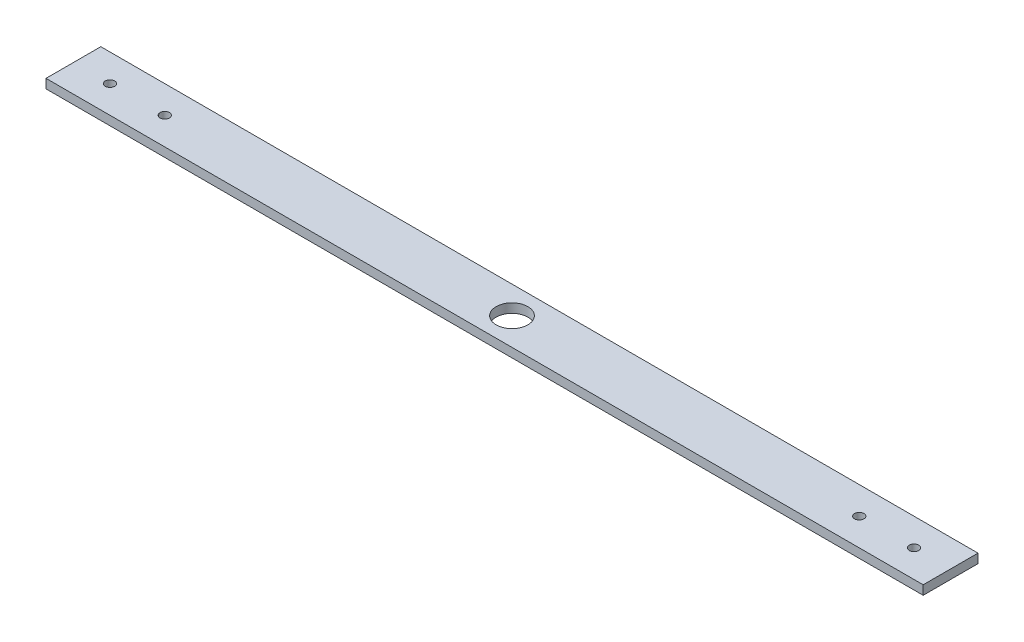
ISO-10303-21;
HEADER;
FILE_DESCRIPTION(('STEP AP214'),'2;1');
FILE_NAME('part.step','',(''),(''),'','','');
FILE_SCHEMA(('AUTOMOTIVE_DESIGN { 1 0 10303 214 1 1 1 1 }'));
ENDSEC;
DATA;
#1=APPLICATION_CONTEXT('core data for automotive mechanical design processes');
#2=APPLICATION_PROTOCOL_DEFINITION('international standard','automotive_design',2000,#1);
#3=PRODUCT_CONTEXT('',#1,'mechanical');
#4=PRODUCT('Part','Part','',(#3));
#5=PRODUCT_RELATED_PRODUCT_CATEGORY('part','',(#4));
#6=PRODUCT_DEFINITION_FORMATION('','',#4);
#7=PRODUCT_DEFINITION_CONTEXT('part definition',#1,'design');
#8=PRODUCT_DEFINITION('design','',#6,#7);
#9=PRODUCT_DEFINITION_SHAPE('','',#8);
#10=(LENGTH_UNIT() NAMED_UNIT(*) SI_UNIT(.MILLI.,.METRE.));
#11=(NAMED_UNIT(*) PLANE_ANGLE_UNIT() SI_UNIT($,.RADIAN.));
#12=(NAMED_UNIT(*) SI_UNIT($,.STERADIAN.) SOLID_ANGLE_UNIT());
#13=UNCERTAINTY_MEASURE_WITH_UNIT(LENGTH_MEASURE(1.E-05),#10,'distance_accuracy_value','');
#14=(GEOMETRIC_REPRESENTATION_CONTEXT(3) GLOBAL_UNCERTAINTY_ASSIGNED_CONTEXT((#13)) GLOBAL_UNIT_ASSIGNED_CONTEXT((#10,
#11,#12)) REPRESENTATION_CONTEXT('',''));
#15=CARTESIAN_POINT('',(0.,0.,0.));
#16=DIRECTION('',(0.,0.,1.));
#17=DIRECTION('',(1.,0.,0.));
#18=AXIS2_PLACEMENT_3D('',#15,#16,#17);
#19=CARTESIAN_POINT('',(0.,0.,0.));
#20=DIRECTION('',(0.,-1.,0.));
#21=DIRECTION('',(0.,0.,-1.));
#22=AXIS2_PLACEMENT_3D('',#19,#20,#21);
#23=PLANE('',#22);
#24=DIRECTION('',(0.,0.,-1.));
#25=VECTOR('',#24,1.);
#26=CARTESIAN_POINT('',(304.8,0.,19.05));
#27=LINE('',#26,#25);
#28=CARTESIAN_POINT('',(304.8,0.,19.05));
#29=VERTEX_POINT('',#28);
#30=CARTESIAN_POINT('',(304.8,0.,-19.05));
#31=VERTEX_POINT('',#30);
#32=EDGE_CURVE('E112',#29,#31,#27,.T.);
#33=ORIENTED_EDGE('',*,*,#32,.F.);
#34=DIRECTION('',(1.,0.,0.));
#35=VECTOR('',#34,1.);
#36=CARTESIAN_POINT('',(-304.8,0.,19.05));
#37=LINE('',#36,#35);
#38=CARTESIAN_POINT('',(-304.8,0.,19.05));
#39=VERTEX_POINT('',#38);
#40=EDGE_CURVE('E82',#39,#29,#37,.T.);
#41=ORIENTED_EDGE('',*,*,#40,.F.);
#42=DIRECTION('',(0.,0.,1.));
#43=VECTOR('',#42,1.);
#44=CARTESIAN_POINT('',(-304.8,0.,19.05));
#45=LINE('',#44,#43);
#46=CARTESIAN_POINT('',(-304.8,0.,-19.05));
#47=VERTEX_POINT('',#46);
#48=EDGE_CURVE('E76',#47,#39,#45,.T.);
#49=ORIENTED_EDGE('',*,*,#48,.F.);
#50=DIRECTION('',(-1.,0.,0.));
#51=VECTOR('',#50,1.);
#52=CARTESIAN_POINT('',(-304.8,0.,-19.05));
#53=LINE('',#52,#51);
#54=EDGE_CURVE('E99',#31,#47,#53,.T.);
#55=ORIENTED_EDGE('',*,*,#54,.F.);
#56=EDGE_LOOP('',(#33,#41,#49,#55));
#57=FACE_BOUND('',#56,.T.);
#58=CARTESIAN_POINT('',(0.,0.,0.));
#59=DIRECTION('',(0.,-1.,0.));
#60=DIRECTION('',(0.,0.,-1.));
#61=AXIS2_PLACEMENT_3D('',#58,#59,#60);
#62=CIRCLE('',#61,11.);
#63=CARTESIAN_POINT('',(0.,0.,-11.));
#64=VERTEX_POINT('',#63);
#65=EDGE_CURVE('E44',#64,#64,#62,.T.);
#66=ORIENTED_EDGE('',*,*,#65,.F.);
#67=EDGE_LOOP('',(#66));
#68=FACE_BOUND('',#67,.T.);
#69=CARTESIAN_POINT('',(-241.3,0.,0.));
#70=DIRECTION('',(0.,1.,0.));
#71=DIRECTION('',(0.,0.,1.));
#72=AXIS2_PLACEMENT_3D('',#69,#70,#71);
#73=CIRCLE('',#72,3.26389999999999);
#74=CARTESIAN_POINT('',(-241.3,0.,3.26390000000002));
#75=VERTEX_POINT('',#74);
#76=EDGE_CURVE('E138',#75,#75,#73,.T.);
#77=ORIENTED_EDGE('',*,*,#76,.T.);
#78=EDGE_LOOP('',(#77));
#79=FACE_BOUND('',#78,.T.);
#80=CARTESIAN_POINT('',(-279.4,0.,0.));
#81=DIRECTION('',(0.,1.,0.));
#82=DIRECTION('',(0.,0.,1.));
#83=AXIS2_PLACEMENT_3D('',#80,#81,#82);
#84=CIRCLE('',#83,3.26389999999999);
#85=CARTESIAN_POINT('',(-279.4,0.,3.26390000000002));
#86=VERTEX_POINT('',#85);
#87=EDGE_CURVE('E146',#86,#86,#84,.T.);
#88=ORIENTED_EDGE('',*,*,#87,.T.);
#89=EDGE_LOOP('',(#88));
#90=FACE_BOUND('',#89,.T.);
#91=CARTESIAN_POINT('',(241.3,0.,0.));
#92=DIRECTION('',(0.,1.,0.));
#93=DIRECTION('',(0.,0.,1.));
#94=AXIS2_PLACEMENT_3D('',#91,#92,#93);
#95=CIRCLE('',#94,3.26389999999999);
#96=CARTESIAN_POINT('',(241.3,0.,3.26390000000002));
#97=VERTEX_POINT('',#96);
#98=EDGE_CURVE('E154',#97,#97,#95,.T.);
#99=ORIENTED_EDGE('',*,*,#98,.T.);
#100=EDGE_LOOP('',(#99));
#101=FACE_BOUND('',#100,.T.);
#102=CARTESIAN_POINT('',(279.4,0.,0.));
#103=DIRECTION('',(0.,1.,0.));
#104=DIRECTION('',(0.,0.,1.));
#105=AXIS2_PLACEMENT_3D('',#102,#103,#104);
#106=CIRCLE('',#105,3.26389999999999);
#107=CARTESIAN_POINT('',(279.4,0.,3.26390000000002));
#108=VERTEX_POINT('',#107);
#109=EDGE_CURVE('E162',#108,#108,#106,.T.);
#110=ORIENTED_EDGE('',*,*,#109,.T.);
#111=EDGE_LOOP('',(#110));
#112=FACE_BOUND('',#111,.T.);
#113=ADVANCED_FACE('F40',(#57,#68,#79,#90,#101,#112),#23,.T.);
#114=CARTESIAN_POINT('',(304.8,6.35,19.05));
#115=DIRECTION('',(-1.,0.,0.));
#116=DIRECTION('',(0.,0.,1.));
#117=AXIS2_PLACEMENT_3D('',#114,#115,#116);
#118=PLANE('',#117);
#119=ORIENTED_EDGE('',*,*,#32,.T.);
#120=DIRECTION('',(0.,-1.,0.));
#121=VECTOR('',#120,1.);
#122=CARTESIAN_POINT('',(304.8,6.35,-19.05));
#123=LINE('',#122,#121);
#124=CARTESIAN_POINT('',(304.8,6.35,-19.05));
#125=VERTEX_POINT('',#124);
#126=EDGE_CURVE('E11',#125,#31,#123,.T.);
#127=ORIENTED_EDGE('',*,*,#126,.F.);
#128=DIRECTION('',(0.,0.,-1.));
#129=VECTOR('',#128,1.);
#130=CARTESIAN_POINT('',(304.8,6.35,19.05));
#131=LINE('',#130,#129);
#132=CARTESIAN_POINT('',(304.8,6.35,19.05));
#133=VERTEX_POINT('',#132);
#134=EDGE_CURVE('E94',#133,#125,#131,.T.);
#135=ORIENTED_EDGE('',*,*,#134,.F.);
#136=DIRECTION('',(0.,-1.,0.));
#137=VECTOR('',#136,1.);
#138=CARTESIAN_POINT('',(304.8,6.35,19.05));
#139=LINE('',#138,#137);
#140=EDGE_CURVE('E108',#133,#29,#139,.T.);
#141=ORIENTED_EDGE('',*,*,#140,.T.);
#142=EDGE_LOOP('',(#119,#127,#135,#141));
#143=FACE_BOUND('',#142,.T.);
#144=ADVANCED_FACE('F42',(#143),#118,.F.);
#145=CARTESIAN_POINT('',(-304.8,6.35,-19.05));
#146=DIRECTION('',(0.,0.,1.));
#147=DIRECTION('',(1.,0.,0.));
#148=AXIS2_PLACEMENT_3D('',#145,#146,#147);
#149=PLANE('',#148);
#150=ORIENTED_EDGE('',*,*,#54,.T.);
#151=DIRECTION('',(0.,-1.,0.));
#152=VECTOR('',#151,1.);
#153=CARTESIAN_POINT('',(-304.8,6.35,-19.05));
#154=LINE('',#153,#152);
#155=CARTESIAN_POINT('',(-304.8,6.35,-19.05));
#156=VERTEX_POINT('',#155);
#157=EDGE_CURVE('E51',#156,#47,#154,.T.);
#158=ORIENTED_EDGE('',*,*,#157,.F.);
#159=DIRECTION('',(-1.,0.,0.));
#160=VECTOR('',#159,1.);
#161=CARTESIAN_POINT('',(-304.8,6.35,-19.05));
#162=LINE('',#161,#160);
#163=EDGE_CURVE('E89',#125,#156,#162,.T.);
#164=ORIENTED_EDGE('',*,*,#163,.F.);
#165=ORIENTED_EDGE('',*,*,#126,.T.);
#166=EDGE_LOOP('',(#150,#158,#164,#165));
#167=FACE_BOUND('',#166,.T.);
#168=ADVANCED_FACE('F98',(#167),#149,.F.);
#169=CARTESIAN_POINT('',(-304.8,6.35,19.05));
#170=DIRECTION('',(1.,0.,0.));
#171=DIRECTION('',(0.,0.,-1.));
#172=AXIS2_PLACEMENT_3D('',#169,#170,#171);
#173=PLANE('',#172);
#174=ORIENTED_EDGE('',*,*,#48,.T.);
#175=DIRECTION('',(0.,-1.,0.));
#176=VECTOR('',#175,1.);
#177=CARTESIAN_POINT('',(-304.8,6.35,19.05));
#178=LINE('',#177,#176);
#179=CARTESIAN_POINT('',(-304.8,6.35,19.05));
#180=VERTEX_POINT('',#179);
#181=EDGE_CURVE('E101',#180,#39,#178,.T.);
#182=ORIENTED_EDGE('',*,*,#181,.F.);
#183=DIRECTION('',(0.,0.,1.));
#184=VECTOR('',#183,1.);
#185=CARTESIAN_POINT('',(-304.8,6.35,19.05));
#186=LINE('',#185,#184);
#187=EDGE_CURVE('E92',#156,#180,#186,.T.);
#188=ORIENTED_EDGE('',*,*,#187,.F.);
#189=ORIENTED_EDGE('',*,*,#157,.T.);
#190=EDGE_LOOP('',(#174,#182,#188,#189));
#191=FACE_BOUND('',#190,.T.);
#192=ADVANCED_FACE('F103',(#191),#173,.F.);
#193=CARTESIAN_POINT('',(-304.8,6.35,19.05));
#194=DIRECTION('',(0.,0.,-1.));
#195=DIRECTION('',(-1.,0.,0.));
#196=AXIS2_PLACEMENT_3D('',#193,#194,#195);
#197=PLANE('',#196);
#198=ORIENTED_EDGE('',*,*,#40,.T.);
#199=ORIENTED_EDGE('',*,*,#140,.F.);
#200=DIRECTION('',(1.,0.,0.));
#201=VECTOR('',#200,1.);
#202=CARTESIAN_POINT('',(-304.8,6.35,19.05));
#203=LINE('',#202,#201);
#204=EDGE_CURVE('E59',#180,#133,#203,.T.);
#205=ORIENTED_EDGE('',*,*,#204,.F.);
#206=ORIENTED_EDGE('',*,*,#181,.T.);
#207=EDGE_LOOP('',(#198,#199,#205,#206));
#208=FACE_BOUND('',#207,.T.);
#209=ADVANCED_FACE('F126',(#208),#197,.F.);
#210=CARTESIAN_POINT('',(0.,6.35,0.));
#211=DIRECTION('',(0.,-1.,0.));
#212=DIRECTION('',(0.,0.,-1.));
#213=AXIS2_PLACEMENT_3D('',#210,#211,#212);
#214=PLANE('',#213);
#215=CARTESIAN_POINT('',(279.4,6.35,0.));
#216=DIRECTION('',(0.,1.,0.));
#217=DIRECTION('',(0.,0.,1.));
#218=AXIS2_PLACEMENT_3D('',#215,#216,#217);
#219=CIRCLE('',#218,3.26389999999999);
#220=CARTESIAN_POINT('',(279.4,6.35,3.26390000000002));
#221=VERTEX_POINT('',#220);
#222=EDGE_CURVE('E166',#221,#221,#219,.T.);
#223=ORIENTED_EDGE('',*,*,#222,.F.);
#224=EDGE_LOOP('',(#223));
#225=FACE_BOUND('',#224,.T.);
#226=CARTESIAN_POINT('',(241.3,6.35,0.));
#227=DIRECTION('',(0.,1.,0.));
#228=DIRECTION('',(0.,0.,1.));
#229=AXIS2_PLACEMENT_3D('',#226,#227,#228);
#230=CIRCLE('',#229,3.26389999999999);
#231=CARTESIAN_POINT('',(241.3,6.35,3.26390000000002));
#232=VERTEX_POINT('',#231);
#233=EDGE_CURVE('E158',#232,#232,#230,.T.);
#234=ORIENTED_EDGE('',*,*,#233,.F.);
#235=EDGE_LOOP('',(#234));
#236=FACE_BOUND('',#235,.T.);
#237=CARTESIAN_POINT('',(-279.4,6.35,0.));
#238=DIRECTION('',(0.,1.,0.));
#239=DIRECTION('',(0.,0.,1.));
#240=AXIS2_PLACEMENT_3D('',#237,#238,#239);
#241=CIRCLE('',#240,3.26389999999999);
#242=CARTESIAN_POINT('',(-279.4,6.35,3.26390000000002));
#243=VERTEX_POINT('',#242);
#244=EDGE_CURVE('E150',#243,#243,#241,.T.);
#245=ORIENTED_EDGE('',*,*,#244,.F.);
#246=EDGE_LOOP('',(#245));
#247=FACE_BOUND('',#246,.T.);
#248=CARTESIAN_POINT('',(-241.3,6.35,0.));
#249=DIRECTION('',(0.,1.,0.));
#250=DIRECTION('',(0.,0.,1.));
#251=AXIS2_PLACEMENT_3D('',#248,#249,#250);
#252=CIRCLE('',#251,3.26389999999999);
#253=CARTESIAN_POINT('',(-241.3,6.35,3.26390000000002));
#254=VERTEX_POINT('',#253);
#255=EDGE_CURVE('E142',#254,#254,#252,.T.);
#256=ORIENTED_EDGE('',*,*,#255,.F.);
#257=EDGE_LOOP('',(#256));
#258=FACE_BOUND('',#257,.T.);
#259=CARTESIAN_POINT('',(0.,6.35,0.));
#260=DIRECTION('',(0.,1.,0.));
#261=DIRECTION('',(0.,0.,1.));
#262=AXIS2_PLACEMENT_3D('',#259,#260,#261);
#263=CIRCLE('',#262,11.);
#264=CARTESIAN_POINT('',(0.,6.35,11.));
#265=VERTEX_POINT('',#264);
#266=EDGE_CURVE('E134',#265,#265,#263,.T.);
#267=ORIENTED_EDGE('',*,*,#266,.F.);
#268=EDGE_LOOP('',(#267));
#269=FACE_BOUND('',#268,.T.);
#270=ORIENTED_EDGE('',*,*,#134,.T.);
#271=ORIENTED_EDGE('',*,*,#163,.T.);
#272=ORIENTED_EDGE('',*,*,#187,.T.);
#273=ORIENTED_EDGE('',*,*,#204,.T.);
#274=EDGE_LOOP('',(#270,#271,#272,#273));
#275=FACE_BOUND('',#274,.T.);
#276=ADVANCED_FACE('F90',(#225,#236,#247,#258,#269,#275),#214,.F.);
#277=CARTESIAN_POINT('',(0.,-1.27,0.));
#278=DIRECTION('',(0.,1.,0.));
#279=DIRECTION('',(0.,0.,1.));
#280=AXIS2_PLACEMENT_3D('',#277,#278,#279);
#281=CYLINDRICAL_SURFACE('',#280,11.);
#282=ORIENTED_EDGE('',*,*,#65,.T.);
#283=EDGE_LOOP('',(#282));
#284=FACE_BOUND('',#283,.T.);
#285=ORIENTED_EDGE('',*,*,#266,.T.);
#286=EDGE_LOOP('',(#285));
#287=FACE_BOUND('',#286,.T.);
#288=ADVANCED_FACE('F176',(#284,#287),#281,.F.);
#289=CARTESIAN_POINT('',(-241.3,6.35,0.));
#290=DIRECTION('',(0.,1.,0.));
#291=DIRECTION('',(0.,0.,1.));
#292=AXIS2_PLACEMENT_3D('',#289,#290,#291);
#293=CYLINDRICAL_SURFACE('',#292,3.26389999999999);
#294=ORIENTED_EDGE('',*,*,#76,.F.);
#295=EDGE_LOOP('',(#294));
#296=FACE_BOUND('',#295,.T.);
#297=ORIENTED_EDGE('',*,*,#255,.T.);
#298=EDGE_LOOP('',(#297));
#299=FACE_BOUND('',#298,.T.);
#300=ADVANCED_FACE('F187',(#296,#299),#293,.F.);
#301=CARTESIAN_POINT('',(-279.4,6.35,0.));
#302=DIRECTION('',(0.,1.,0.));
#303=DIRECTION('',(0.,0.,1.));
#304=AXIS2_PLACEMENT_3D('',#301,#302,#303);
#305=CYLINDRICAL_SURFACE('',#304,3.26389999999999);
#306=ORIENTED_EDGE('',*,*,#87,.F.);
#307=EDGE_LOOP('',(#306));
#308=FACE_BOUND('',#307,.T.);
#309=ORIENTED_EDGE('',*,*,#244,.T.);
#310=EDGE_LOOP('',(#309));
#311=FACE_BOUND('',#310,.T.);
#312=ADVANCED_FACE('F193',(#308,#311),#305,.F.);
#313=CARTESIAN_POINT('',(241.3,6.35,0.));
#314=DIRECTION('',(0.,1.,0.));
#315=DIRECTION('',(0.,0.,1.));
#316=AXIS2_PLACEMENT_3D('',#313,#314,#315);
#317=CYLINDRICAL_SURFACE('',#316,3.26389999999999);
#318=ORIENTED_EDGE('',*,*,#98,.F.);
#319=EDGE_LOOP('',(#318));
#320=FACE_BOUND('',#319,.T.);
#321=ORIENTED_EDGE('',*,*,#233,.T.);
#322=EDGE_LOOP('',(#321));
#323=FACE_BOUND('',#322,.T.);
#324=ADVANCED_FACE('F244',(#320,#323),#317,.F.);
#325=CARTESIAN_POINT('',(279.4,6.35,0.));
#326=DIRECTION('',(0.,1.,0.));
#327=DIRECTION('',(0.,0.,1.));
#328=AXIS2_PLACEMENT_3D('',#325,#326,#327);
#329=CYLINDRICAL_SURFACE('',#328,3.26389999999999);
#330=ORIENTED_EDGE('',*,*,#109,.F.);
#331=EDGE_LOOP('',(#330));
#332=FACE_BOUND('',#331,.T.);
#333=ORIENTED_EDGE('',*,*,#222,.T.);
#334=EDGE_LOOP('',(#333));
#335=FACE_BOUND('',#334,.T.);
#336=ADVANCED_FACE('F172',(#332,#335),#329,.F.);
#337=CLOSED_SHELL('',(#113,#144,#168,#192,#209,#276,#288,#300,#312,#324,#336));
#338=MANIFOLD_SOLID_BREP('B2',#337);
#339=ADVANCED_BREP_SHAPE_REPRESENTATION('',(#18,#338),#14);
#340=SHAPE_DEFINITION_REPRESENTATION(#9,#339);
ENDSEC;
END-ISO-10303-21;
